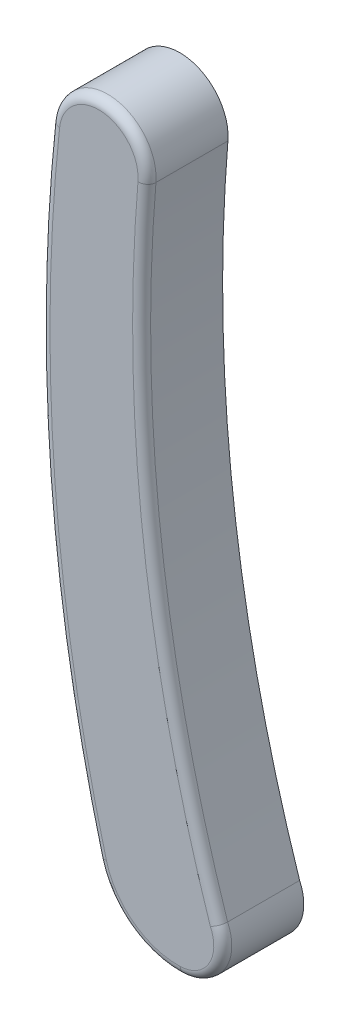
ISO-10303-21;
HEADER;
FILE_DESCRIPTION(('STEP AP214'),'2;1');
FILE_NAME('part.step','',(''),(''),'','','');
FILE_SCHEMA(('AUTOMOTIVE_DESIGN { 1 0 10303 214 1 1 1 1 }'));
ENDSEC;
DATA;
#1=APPLICATION_CONTEXT('core data for automotive mechanical design processes');
#2=APPLICATION_PROTOCOL_DEFINITION('international standard','automotive_design',2000,#1);
#3=PRODUCT_CONTEXT('',#1,'mechanical');
#4=PRODUCT('Part','Part','',(#3));
#5=PRODUCT_RELATED_PRODUCT_CATEGORY('part','',(#4));
#6=PRODUCT_DEFINITION_FORMATION('','',#4);
#7=PRODUCT_DEFINITION_CONTEXT('part definition',#1,'design');
#8=PRODUCT_DEFINITION('design','',#6,#7);
#9=PRODUCT_DEFINITION_SHAPE('','',#8);
#10=(LENGTH_UNIT() NAMED_UNIT(*) SI_UNIT(.MILLI.,.METRE.));
#11=(NAMED_UNIT(*) PLANE_ANGLE_UNIT() SI_UNIT($,.RADIAN.));
#12=(NAMED_UNIT(*) SI_UNIT($,.STERADIAN.) SOLID_ANGLE_UNIT());
#13=UNCERTAINTY_MEASURE_WITH_UNIT(LENGTH_MEASURE(1.E-05),#10,'distance_accuracy_value','');
#14=(GEOMETRIC_REPRESENTATION_CONTEXT(3) GLOBAL_UNCERTAINTY_ASSIGNED_CONTEXT((#13)) GLOBAL_UNIT_ASSIGNED_CONTEXT((#10,
#11,#12)) REPRESENTATION_CONTEXT('',''));
#15=CARTESIAN_POINT('',(0.,0.,0.));
#16=DIRECTION('',(0.,0.,1.));
#17=DIRECTION('',(1.,0.,0.));
#18=AXIS2_PLACEMENT_3D('',#15,#16,#17);
#19=CARTESIAN_POINT('',(84.9762509135263,10.0158847201364,4.5));
#20=DIRECTION('',(0.,0.,-1.));
#21=DIRECTION('',(-1.,0.,0.));
#22=AXIS2_PLACEMENT_3D('',#19,#20,#21);
#23=CYLINDRICAL_SURFACE('',#22,84.4353434391339);
#24=DIRECTION('',(0.,0.,-1.));
#25=VECTOR('',#24,1.);
#26=CARTESIAN_POINT('',(0.835946957190346,17.0682936575059,4.5));
#27=LINE('',#26,#25);
#28=CARTESIAN_POINT('',(0.835946957190346,17.0682936575059,4.));
#29=VERTEX_POINT('',#28);
#30=CARTESIAN_POINT('',(0.835946957190346,17.0682936575059,0.));
#31=VERTEX_POINT('',#30);
#32=EDGE_CURVE('E104',#29,#31,#27,.T.);
#33=ORIENTED_EDGE('',*,*,#32,.F.);
#34=CARTESIAN_POINT('',(84.9762509135263,10.0158847201364,4.));
#35=DIRECTION('',(0.,0.,1.));
#36=DIRECTION('',(1.,0.,0.));
#37=AXIS2_PLACEMENT_3D('',#34,#35,#36);
#38=CIRCLE('',#37,84.4353434391339);
#39=CARTESIAN_POINT('',(4.81928040610532,-16.5206429494178,4.));
#40=VERTEX_POINT('',#39);
#41=EDGE_CURVE('E11',#29,#40,#38,.T.);
#42=ORIENTED_EDGE('',*,*,#41,.T.);
#43=DIRECTION('',(0.,0.,-1.));
#44=VECTOR('',#43,1.);
#45=CARTESIAN_POINT('',(4.81928040610532,-16.5206429494178,4.5));
#46=LINE('',#45,#44);
#47=CARTESIAN_POINT('',(4.81928040610532,-16.5206429494178,0.));
#48=VERTEX_POINT('',#47);
#49=EDGE_CURVE('E125',#40,#48,#46,.T.);
#50=ORIENTED_EDGE('',*,*,#49,.T.);
#51=CARTESIAN_POINT('',(84.9762509135263,10.0158847201364,0.));
#52=DIRECTION('',(0.,0.,-1.));
#53=DIRECTION('',(1.,0.,0.));
#54=AXIS2_PLACEMENT_3D('',#51,#52,#53);
#55=CIRCLE('',#54,84.4353434391339);
#56=EDGE_CURVE('E119',#48,#31,#55,.T.);
#57=ORIENTED_EDGE('',*,*,#56,.T.);
#58=EDGE_LOOP('',(#33,#42,#50,#57));
#59=FACE_BOUND('',#58,.T.);
#60=ADVANCED_FACE('F43',(#59),#23,.F.);
#61=CARTESIAN_POINT('',(-1.84164816046532,17.2927223183319,4.5));
#62=DIRECTION('',(0.,0.,-1.));
#63=DIRECTION('',(-1.,0.,0.));
#64=AXIS2_PLACEMENT_3D('',#61,#62,#63);
#65=CYLINDRICAL_SURFACE('',#64,2.68698415289216);
#66=DIRECTION('',(0.,0.,-1.));
#67=VECTOR('',#66,1.);
#68=CARTESIAN_POINT('',(-4.51322700928739,17.5800379851866,4.5));
#69=LINE('',#68,#67);
#70=CARTESIAN_POINT('',(-4.51322700928739,17.5800379851866,4.));
#71=VERTEX_POINT('',#70);
#72=CARTESIAN_POINT('',(-4.51322700928739,17.5800379851866,0.));
#73=VERTEX_POINT('',#72);
#74=EDGE_CURVE('E113',#71,#73,#69,.T.);
#75=ORIENTED_EDGE('',*,*,#74,.F.);
#76=CARTESIAN_POINT('',(-1.84164816046532,17.2927223183319,4.));
#77=DIRECTION('',(0.,0.,1.));
#78=DIRECTION('',(1.,0.,0.));
#79=AXIS2_PLACEMENT_3D('',#76,#77,#78);
#80=CIRCLE('',#79,2.68698415289216);
#81=EDGE_CURVE('E52',#71,#29,#80,.F.);
#82=ORIENTED_EDGE('',*,*,#81,.T.);
#83=ORIENTED_EDGE('',*,*,#32,.T.);
#84=CARTESIAN_POINT('',(-1.84164816046532,17.2927223183319,0.));
#85=DIRECTION('',(0.,0.,1.));
#86=DIRECTION('',(1.,0.,0.));
#87=AXIS2_PLACEMENT_3D('',#84,#85,#86);
#88=CIRCLE('',#87,2.68698415289216);
#89=EDGE_CURVE('E107',#31,#73,#88,.T.);
#90=ORIENTED_EDGE('',*,*,#89,.T.);
#91=EDGE_LOOP('',(#75,#82,#83,#90));
#92=FACE_BOUND('',#91,.T.);
#93=ADVANCED_FACE('F106',(#92),#65,.T.);
#94=CARTESIAN_POINT('',(88.7130321548861,7.55399483398771,4.5));
#95=DIRECTION('',(0.,0.,-1.));
#96=DIRECTION('',(-1.,0.,0.));
#97=AXIS2_PLACEMENT_3D('',#94,#95,#96);
#98=CYLINDRICAL_SURFACE('',#97,93.7638359870975);
#99=DIRECTION('',(0.,0.,-1.));
#100=VECTOR('',#99,1.);
#101=CARTESIAN_POINT('',(-1.8993925612886,-16.5508890294723,4.5));
#102=LINE('',#101,#100);
#103=CARTESIAN_POINT('',(-1.8993925612886,-16.5508890294723,4.));
#104=VERTEX_POINT('',#103);
#105=CARTESIAN_POINT('',(-1.8993925612886,-16.5508890294723,0.));
#106=VERTEX_POINT('',#105);
#107=EDGE_CURVE('E140',#104,#106,#102,.T.);
#108=ORIENTED_EDGE('',*,*,#107,.F.);
#109=CARTESIAN_POINT('',(88.7130321548861,7.55399483398771,4.));
#110=DIRECTION('',(0.,0.,1.));
#111=DIRECTION('',(1.,0.,0.));
#112=AXIS2_PLACEMENT_3D('',#109,#110,#111);
#113=CIRCLE('',#112,93.7638359870975);
#114=EDGE_CURVE('E67',#104,#71,#113,.F.);
#115=ORIENTED_EDGE('',*,*,#114,.T.);
#116=ORIENTED_EDGE('',*,*,#74,.T.);
#117=CARTESIAN_POINT('',(88.7130321548861,7.55399483398771,0.));
#118=DIRECTION('',(0.,0.,1.));
#119=DIRECTION('',(1.,0.,0.));
#120=AXIS2_PLACEMENT_3D('',#117,#118,#119);
#121=CIRCLE('',#120,93.7638359870975);
#122=EDGE_CURVE('E122',#73,#106,#121,.T.);
#123=ORIENTED_EDGE('',*,*,#122,.T.);
#124=EDGE_LOOP('',(#108,#115,#116,#123));
#125=FACE_BOUND('',#124,.T.);
#126=ADVANCED_FACE('F193',(#125),#98,.T.);
#127=CARTESIAN_POINT('',(2.56081611016571,-15.3643761161609,4.5));
#128=DIRECTION('',(0.,0.,-1.));
#129=DIRECTION('',(-1.,0.,0.));
#130=AXIS2_PLACEMENT_3D('',#127,#128,#129);
#131=CYLINDRICAL_SURFACE('',#130,4.61533035506345);
#132=DIRECTION('',(0.,0.,-1.));
#133=VECTOR('',#132,1.);
#134=CARTESIAN_POINT('',(2.69940274493787,-19.9776252998743,4.5));
#135=LINE('',#134,#133);
#136=CARTESIAN_POINT('',(2.69940274493787,-19.9776252998743,4.));
#137=VERTEX_POINT('',#136);
#138=CARTESIAN_POINT('',(2.69940274493787,-19.9776252998743,0.));
#139=VERTEX_POINT('',#138);
#140=EDGE_CURVE('E138',#137,#139,#135,.T.);
#141=ORIENTED_EDGE('',*,*,#140,.F.);
#142=CARTESIAN_POINT('',(2.56081611016571,-15.3643761161609,4.));
#143=DIRECTION('',(0.,0.,1.));
#144=DIRECTION('',(1.,0.,0.));
#145=AXIS2_PLACEMENT_3D('',#142,#143,#144);
#146=CIRCLE('',#145,4.61533035506345);
#147=EDGE_CURVE('E156',#137,#104,#146,.F.);
#148=ORIENTED_EDGE('',*,*,#147,.T.);
#149=ORIENTED_EDGE('',*,*,#107,.T.);
#150=CARTESIAN_POINT('',(2.56081611016571,-15.3643761161609,0.));
#151=DIRECTION('',(0.,0.,1.));
#152=DIRECTION('',(1.,0.,0.));
#153=AXIS2_PLACEMENT_3D('',#150,#151,#152);
#154=CIRCLE('',#153,4.61533035506345);
#155=EDGE_CURVE('E132',#106,#139,#154,.T.);
#156=ORIENTED_EDGE('',*,*,#155,.T.);
#157=EDGE_LOOP('',(#141,#148,#149,#156));
#158=FACE_BOUND('',#157,.T.);
#159=ADVANCED_FACE('F198',(#158),#131,.T.);
#160=CARTESIAN_POINT('',(2.62661037976232,-17.5545249787014,4.5));
#161=DIRECTION('',(0.,0.,-1.));
#162=DIRECTION('',(-1.,0.,0.));
#163=AXIS2_PLACEMENT_3D('',#160,#161,#162);
#164=CYLINDRICAL_SURFACE('',#163,2.42419345244941);
#165=ORIENTED_EDGE('',*,*,#49,.F.);
#166=CARTESIAN_POINT('',(2.62661037976232,-17.5545249787014,4.));
#167=DIRECTION('',(0.,0.,1.));
#168=DIRECTION('',(1.,0.,0.));
#169=AXIS2_PLACEMENT_3D('',#166,#167,#168);
#170=CIRCLE('',#169,2.42419345244941);
#171=EDGE_CURVE('E153',#40,#137,#170,.F.);
#172=ORIENTED_EDGE('',*,*,#171,.T.);
#173=ORIENTED_EDGE('',*,*,#140,.T.);
#174=CARTESIAN_POINT('',(2.62661037976232,-17.5545249787014,0.));
#175=DIRECTION('',(0.,0.,1.));
#176=DIRECTION('',(1.,0.,0.));
#177=AXIS2_PLACEMENT_3D('',#174,#175,#176);
#178=CIRCLE('',#177,2.42419345244941);
#179=EDGE_CURVE('E135',#139,#48,#178,.T.);
#180=ORIENTED_EDGE('',*,*,#179,.T.);
#181=EDGE_LOOP('',(#165,#172,#173,#180));
#182=FACE_BOUND('',#181,.T.);
#183=ADVANCED_FACE('F201',(#182),#164,.T.);
#184=CARTESIAN_POINT('',(43.8014306466443,-3.76932012928247,4.5));
#185=DIRECTION('',(0.,0.,1.));
#186=DIRECTION('',(1.,0.,0.));
#187=AXIS2_PLACEMENT_3D('',#184,#185,#186);
#188=PLANE('',#187);
#189=CARTESIAN_POINT('',(2.56081611016571,-15.3643761161609,4.5));
#190=DIRECTION('',(0.,0.,1.));
#191=DIRECTION('',(1.,0.,0.));
#192=AXIS2_PLACEMENT_3D('',#189,#190,#191);
#193=CIRCLE('',#192,4.11533035506345);
#194=CARTESIAN_POINT('',(-1.41619760791317,-16.4223486193574,4.5));
#195=VERTEX_POINT('',#194);
#196=CARTESIAN_POINT('',(2.68438901633011,-19.4778507627545,4.5));
#197=VERTEX_POINT('',#196);
#198=EDGE_CURVE('E148',#195,#197,#193,.T.);
#199=ORIENTED_EDGE('',*,*,#198,.T.);
#200=CARTESIAN_POINT('',(2.62661037976232,-17.5545249787014,4.5));
#201=DIRECTION('',(0.,0.,1.));
#202=DIRECTION('',(1.,0.,0.));
#203=AXIS2_PLACEMENT_3D('',#200,#201,#202);
#204=CIRCLE('',#203,1.92419345244941);
#205=CARTESIAN_POINT('',(4.35469713101639,-16.708217338071,4.5));
#206=VERTEX_POINT('',#205);
#207=EDGE_CURVE('E150',#197,#206,#204,.T.);
#208=ORIENTED_EDGE('',*,*,#207,.T.);
#209=CARTESIAN_POINT('',(84.9762509135263,10.0158847201364,4.5));
#210=DIRECTION('',(0.,0.,1.));
#211=DIRECTION('',(1.,0.,0.));
#212=AXIS2_PLACEMENT_3D('',#209,#210,#211);
#213=CIRCLE('',#212,84.9353434391339);
#214=CARTESIAN_POINT('',(0.337694089793713,17.1100558429257,4.5));
#215=VERTEX_POINT('',#214);
#216=EDGE_CURVE('E112',#206,#215,#213,.F.);
#217=ORIENTED_EDGE('',*,*,#216,.T.);
#218=CARTESIAN_POINT('',(-1.84164816046532,17.2927223183319,4.5));
#219=DIRECTION('',(0.,0.,1.));
#220=DIRECTION('',(1.,0.,0.));
#221=AXIS2_PLACEMENT_3D('',#218,#219,#220);
#222=CIRCLE('',#221,2.18698415289216);
#223=CARTESIAN_POINT('',(-4.01609366260455,17.5265736455206,4.5));
#224=VERTEX_POINT('',#223);
#225=EDGE_CURVE('E144',#215,#224,#222,.T.);
#226=ORIENTED_EDGE('',*,*,#225,.T.);
#227=CARTESIAN_POINT('',(88.7130321548861,7.55399483398771,4.5));
#228=DIRECTION('',(0.,0.,1.));
#229=DIRECTION('',(1.,0.,0.));
#230=AXIS2_PLACEMENT_3D('',#227,#228,#229);
#231=CIRCLE('',#230,93.2638359870975);
#232=EDGE_CURVE('E146',#224,#195,#231,.T.);
#233=ORIENTED_EDGE('',*,*,#232,.T.);
#234=EDGE_LOOP('',(#199,#208,#217,#226,#233));
#235=FACE_BOUND('',#234,.T.);
#236=ADVANCED_FACE('F205',(#235),#188,.T.);
#237=CARTESIAN_POINT('',(43.8014306466443,-3.76932012928247,0.));
#238=DIRECTION('',(0.,0.,1.));
#239=DIRECTION('',(1.,0.,0.));
#240=AXIS2_PLACEMENT_3D('',#237,#238,#239);
#241=PLANE('',#240);
#242=ORIENTED_EDGE('',*,*,#56,.F.);
#243=ORIENTED_EDGE('',*,*,#179,.F.);
#244=ORIENTED_EDGE('',*,*,#155,.F.);
#245=ORIENTED_EDGE('',*,*,#122,.F.);
#246=ORIENTED_EDGE('',*,*,#89,.F.);
#247=EDGE_LOOP('',(#242,#243,#244,#245,#246));
#248=FACE_BOUND('',#247,.T.);
#249=ADVANCED_FACE('F117',(#248),#241,.F.);
#250=CARTESIAN_POINT('',(88.7130321548861,7.55399483398771,4.));
#251=DIRECTION('',(0.,0.,1.));
#252=DIRECTION('',(1.,0.,0.));
#253=AXIS2_PLACEMENT_3D('',#250,#251,#252);
#254=TOROIDAL_SURFACE('',#253,93.2638359870975,0.5);
#255=CARTESIAN_POINT('',(-1.41619760791317,-16.4223486193574,4.));
#256=DIRECTION('',(0.257080820229842,-0.966389906750868,0.));
#257=DIRECTION('',(0.966389906750868,0.257080820229842,0.));
#258=AXIS2_PLACEMENT_3D('',#255,#256,#257);
#259=CIRCLE('',#258,0.5);
#260=EDGE_CURVE('E129',#195,#104,#259,.T.);
#261=ORIENTED_EDGE('',*,*,#260,.F.);
#262=ORIENTED_EDGE('',*,*,#232,.F.);
#263=CARTESIAN_POINT('',(-4.01609366260444,17.5265736455206,4.));
#264=DIRECTION('',(0.106928679331958,0.99426669336568,0.));
#265=DIRECTION('',(-0.99426669336568,0.106928679331958,0.));
#266=AXIS2_PLACEMENT_3D('',#263,#264,#265);
#267=CIRCLE('',#266,0.5);
#268=EDGE_CURVE('E47',#71,#224,#267,.T.);
#269=ORIENTED_EDGE('',*,*,#268,.F.);
#270=ORIENTED_EDGE('',*,*,#114,.F.);
#271=EDGE_LOOP('',(#261,#262,#269,#270));
#272=FACE_BOUND('',#271,.T.);
#273=ADVANCED_FACE('F45',(#272),#254,.T.);
#274=CARTESIAN_POINT('',(-1.84164816046532,17.2927223183319,4.));
#275=DIRECTION('',(0.,0.,1.));
#276=DIRECTION('',(1.,0.,0.));
#277=AXIS2_PLACEMENT_3D('',#274,#275,#276);
#278=TOROIDAL_SURFACE('',#277,2.18698415289216,0.5);
#279=ORIENTED_EDGE('',*,*,#268,.T.);
#280=ORIENTED_EDGE('',*,*,#225,.F.);
#281=CARTESIAN_POINT('',(0.337694089793713,17.1100558429257,4.));
#282=DIRECTION('',(-0.0835243708394856,-0.996505734793266,0.));
#283=DIRECTION('',(0.996505734793267,-0.0835243708394856,0.));
#284=AXIS2_PLACEMENT_3D('',#281,#282,#283);
#285=CIRCLE('',#284,0.5);
#286=EDGE_CURVE('E221',#29,#215,#285,.T.);
#287=ORIENTED_EDGE('',*,*,#286,.F.);
#288=ORIENTED_EDGE('',*,*,#81,.F.);
#289=EDGE_LOOP('',(#279,#280,#287,#288));
#290=FACE_BOUND('',#289,.T.);
#291=ADVANCED_FACE('F180',(#290),#278,.T.);
#292=CARTESIAN_POINT('',(2.56081611016571,-15.3643761161609,4.));
#293=DIRECTION('',(0.,0.,1.));
#294=DIRECTION('',(1.,0.,0.));
#295=AXIS2_PLACEMENT_3D('',#292,#293,#294);
#296=TOROIDAL_SURFACE('',#295,4.11533035506345,0.5);
#297=ORIENTED_EDGE('',*,*,#260,.T.);
#298=ORIENTED_EDGE('',*,*,#147,.F.);
#299=CARTESIAN_POINT('',(2.68438901633011,-19.4778507627545,4.));
#300=DIRECTION('',(0.999549074239564,0.0300274572155207,0.));
#301=DIRECTION('',(-0.0300274572155207,0.999549074239565,0.));
#302=AXIS2_PLACEMENT_3D('',#299,#300,#301);
#303=CIRCLE('',#302,0.5);
#304=EDGE_CURVE('E168',#197,#137,#303,.T.);
#305=ORIENTED_EDGE('',*,*,#304,.F.);
#306=ORIENTED_EDGE('',*,*,#198,.F.);
#307=EDGE_LOOP('',(#297,#298,#305,#306));
#308=FACE_BOUND('',#307,.T.);
#309=ADVANCED_FACE('F178',(#308),#296,.T.);
#310=CARTESIAN_POINT('',(84.9762509135263,10.0158847201364,4.));
#311=DIRECTION('',(0.,0.,1.));
#312=DIRECTION('',(1.,0.,0.));
#313=AXIS2_PLACEMENT_3D('',#310,#311,#312);
#314=TOROIDAL_SURFACE('',#313,84.9353434391339,0.5);
#315=ORIENTED_EDGE('',*,*,#286,.T.);
#316=ORIENTED_EDGE('',*,*,#216,.F.);
#317=CARTESIAN_POINT('',(4.81928040610555,-16.5206429494177,4.));
#318=CARTESIAN_POINT('',(4.81930293686565,-16.5206344218591,4.02808977685577));
#319=CARTESIAN_POINT('',(4.81707962012974,-16.5215223688371,4.05617214463969));
#320=CARTESIAN_POINT('',(4.80830752036387,-16.5250282750973,4.11152112235147));
#321=CARTESIAN_POINT('',(4.80176204056221,-16.5276449132218,4.13878833864013));
#322=CARTESIAN_POINT('',(4.78450739053132,-16.5345470360942,4.19176358161762));
#323=CARTESIAN_POINT('',(4.77379629675324,-16.53883329182,4.21747088163744));
#324=CARTESIAN_POINT('',(4.74852923039362,-16.5489536860095,4.26658015064291));
#325=CARTESIAN_POINT('',(4.73397413843355,-16.5547874699512,4.28998264595253));
#326=CARTESIAN_POINT('',(4.70142301629795,-16.567849326706,4.33384360324928));
#327=CARTESIAN_POINT('',(4.68342459597052,-16.5750783680541,4.35430000284286));
#328=CARTESIAN_POINT('',(4.6445016304778,-16.590733621743,4.39168048185347));
#329=CARTESIAN_POINT('',(4.62357602599655,-16.5991602675015,4.4086032769464));
#330=CARTESIAN_POINT('',(4.57935950947255,-16.6169949689081,4.43846304511718));
#331=CARTESIAN_POINT('',(4.55606381641873,-16.6264050093704,4.45139174043281));
#332=CARTESIAN_POINT('',(4.50781664103897,-16.6459297200155,4.47284498094046));
#333=CARTESIAN_POINT('',(4.48286678719384,-16.6560436976639,4.48137378714247));
#334=CARTESIAN_POINT('',(4.44243141235688,-16.6724679177675,4.49126504314289));
#335=CARTESIAN_POINT('',(4.42724192279529,-16.6786447448633,4.49413170605619));
#336=CARTESIAN_POINT('',(4.3966939148788,-16.6910823882891,4.4982228207));
#337=CARTESIAN_POINT('',(4.38133566763465,-16.6973430726785,4.49944960214595));
#338=CARTESIAN_POINT('',(4.36221199335169,-16.7051486236132,4.49995090354685));
#339=CARTESIAN_POINT('',(4.3584541677278,-16.7066829001472,4.50000013267901));
#340=CARTESIAN_POINT('',(4.3546971310164,-16.708217338071,4.5));
#341=B_SPLINE_CURVE_WITH_KNOTS('',3,(#317,#318,#319,#320,#321,#322,#323,#324,#325,#326,#327,
#328,#329,#330,#331,#332,#333,#334,#335,#336,#337,#338,#339,#340),.UNSPECIFIED.,.F.,.F.,(4,2,2,
2,2,2,2,2,2,2,2,4),(0.,0.0841568265331835,0.168249410240542,0.252380871439614,0.336493075657643,
0.420663878762146,0.504865221544566,0.589239918506934,0.673532749875151,0.723401432511692,
0.773199193099444,0.785375633705289),.UNSPECIFIED.);
#342=EDGE_CURVE('E160',#40,#206,#341,.T.);
#343=ORIENTED_EDGE('',*,*,#342,.F.);
#344=ORIENTED_EDGE('',*,*,#41,.F.);
#345=EDGE_LOOP('',(#315,#316,#343,#344));
#346=FACE_BOUND('',#345,.T.);
#347=ADVANCED_FACE('F170',(#346),#314,.T.);
#348=CARTESIAN_POINT('',(2.62661037976232,-17.5545249787014,4.));
#349=DIRECTION('',(0.,0.,1.));
#350=DIRECTION('',(1.,0.,0.));
#351=AXIS2_PLACEMENT_3D('',#348,#349,#350);
#352=TOROIDAL_SURFACE('',#351,1.92419345244941,0.5);
#353=ORIENTED_EDGE('',*,*,#304,.T.);
#354=ORIENTED_EDGE('',*,*,#171,.F.);
#355=ORIENTED_EDGE('',*,*,#342,.T.);
#356=ORIENTED_EDGE('',*,*,#207,.F.);
#357=EDGE_LOOP('',(#353,#354,#355,#356));
#358=FACE_BOUND('',#357,.T.);
#359=ADVANCED_FACE('F173',(#358),#352,.T.);
#360=CLOSED_SHELL('',(#60,#93,#126,#159,#183,#236,#249,#273,#291,#309,#347,#359));
#361=MANIFOLD_SOLID_BREP('B2',#360);
#362=ADVANCED_BREP_SHAPE_REPRESENTATION('',(#18,#361),#14);
#363=SHAPE_DEFINITION_REPRESENTATION(#9,#362);
ENDSEC;
END-ISO-10303-21;
